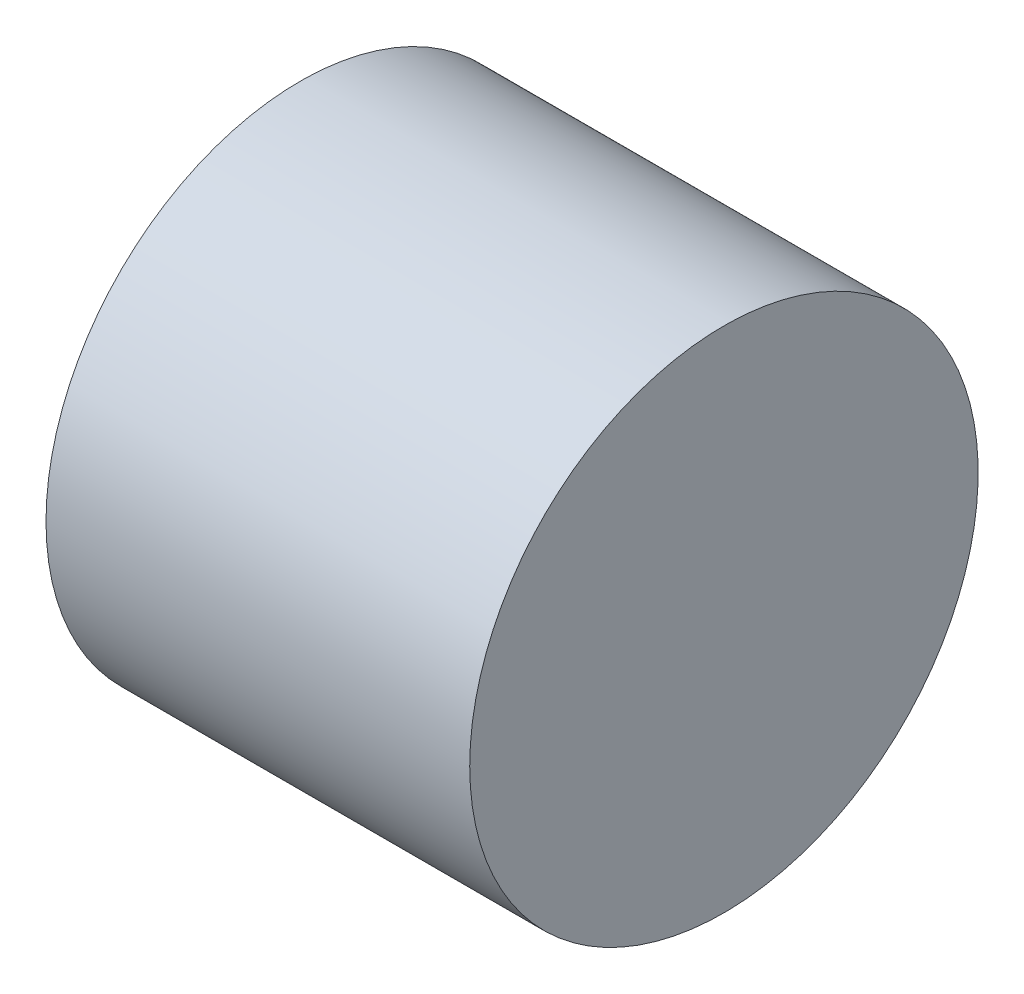
ISO-10303-21;
HEADER;
FILE_DESCRIPTION(('STEP AP214'),'2;1');
FILE_NAME('part.step','',(''),(''),'','','');
FILE_SCHEMA(('AUTOMOTIVE_DESIGN { 1 0 10303 214 1 1 1 1 }'));
ENDSEC;
DATA;
#1=APPLICATION_CONTEXT('core data for automotive mechanical design processes');
#2=APPLICATION_PROTOCOL_DEFINITION('international standard','automotive_design',2000,#1);
#3=PRODUCT_CONTEXT('',#1,'mechanical');
#4=PRODUCT('Part','Part','',(#3));
#5=PRODUCT_RELATED_PRODUCT_CATEGORY('part','',(#4));
#6=PRODUCT_DEFINITION_FORMATION('','',#4);
#7=PRODUCT_DEFINITION_CONTEXT('part definition',#1,'design');
#8=PRODUCT_DEFINITION('design','',#6,#7);
#9=PRODUCT_DEFINITION_SHAPE('','',#8);
#10=(LENGTH_UNIT() NAMED_UNIT(*) SI_UNIT(.MILLI.,.METRE.));
#11=(NAMED_UNIT(*) PLANE_ANGLE_UNIT() SI_UNIT($,.RADIAN.));
#12=(NAMED_UNIT(*) SI_UNIT($,.STERADIAN.) SOLID_ANGLE_UNIT());
#13=UNCERTAINTY_MEASURE_WITH_UNIT(LENGTH_MEASURE(1.E-05),#10,'distance_accuracy_value','');
#14=(GEOMETRIC_REPRESENTATION_CONTEXT(3) GLOBAL_UNCERTAINTY_ASSIGNED_CONTEXT((#13)) GLOBAL_UNIT_ASSIGNED_CONTEXT((#10,
#11,#12)) REPRESENTATION_CONTEXT('',''));
#15=CARTESIAN_POINT('',(0.,0.,0.));
#16=DIRECTION('',(0.,0.,1.));
#17=DIRECTION('',(1.,0.,0.));
#18=AXIS2_PLACEMENT_3D('',#15,#16,#17);
#19=CARTESIAN_POINT('',(-2.5,0.,0.));
#20=DIRECTION('',(1.,0.,0.));
#21=DIRECTION('',(0.,0.,-1.));
#22=AXIS2_PLACEMENT_3D('',#19,#20,#21);
#23=PLANE('',#22);
#24=CARTESIAN_POINT('',(-2.5,0.,0.));
#25=DIRECTION('',(-1.,0.,0.));
#26=DIRECTION('',(0.,0.,1.));
#27=AXIS2_PLACEMENT_3D('',#24,#25,#26);
#28=CIRCLE('',#27,3.);
#29=CARTESIAN_POINT('',(-2.5,0.,3.));
#30=VERTEX_POINT('',#29);
#31=EDGE_CURVE('E10',#30,#30,#28,.T.);
#32=ORIENTED_EDGE('',*,*,#31,.T.);
#33=EDGE_LOOP('',(#32));
#34=FACE_BOUND('',#33,.T.);
#35=ADVANCED_FACE('F30',(#34),#23,.F.);
#36=CARTESIAN_POINT('',(-5.17974617974616,0.,0.));
#37=DIRECTION('',(-1.,0.,0.));
#38=DIRECTION('',(0.,0.,1.));
#39=AXIS2_PLACEMENT_3D('',#36,#37,#38);
#40=CYLINDRICAL_SURFACE('',#39,3.);
#41=ORIENTED_EDGE('',*,*,#31,.F.);
#42=EDGE_LOOP('',(#41));
#43=FACE_BOUND('',#42,.T.);
#44=CARTESIAN_POINT('',(2.5,0.,0.));
#45=DIRECTION('',(-1.,0.,0.));
#46=DIRECTION('',(0.,0.,1.));
#47=AXIS2_PLACEMENT_3D('',#44,#45,#46);
#48=CIRCLE('',#47,3.);
#49=CARTESIAN_POINT('',(2.5,0.,3.));
#50=VERTEX_POINT('',#49);
#51=EDGE_CURVE('E36',#50,#50,#48,.T.);
#52=ORIENTED_EDGE('',*,*,#51,.T.);
#53=EDGE_LOOP('',(#52));
#54=FACE_BOUND('',#53,.T.);
#55=ADVANCED_FACE('F42',(#43,#54),#40,.T.);
#56=CARTESIAN_POINT('',(2.5,0.,-3.));
#57=DIRECTION('',(-1.,0.,0.));
#58=DIRECTION('',(0.,0.,1.));
#59=AXIS2_PLACEMENT_3D('',#56,#57,#58);
#60=PLANE('',#59);
#61=ORIENTED_EDGE('',*,*,#51,.F.);
#62=EDGE_LOOP('',(#61));
#63=FACE_BOUND('',#62,.T.);
#64=ADVANCED_FACE('F44',(#63),#60,.F.);
#65=CLOSED_SHELL('',(#35,#55,#64));
#66=MANIFOLD_SOLID_BREP('B2',#65);
#67=ADVANCED_BREP_SHAPE_REPRESENTATION('',(#18,#66),#14);
#68=SHAPE_DEFINITION_REPRESENTATION(#9,#67);
ENDSEC;
END-ISO-10303-21;
